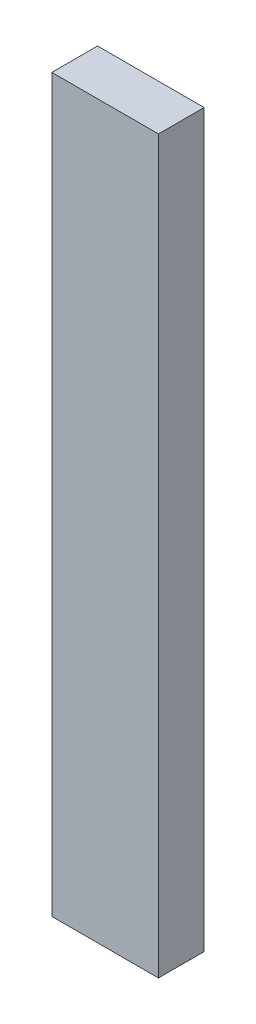
ISO-10303-21;
HEADER;
FILE_DESCRIPTION(('STEP AP214'),'2;1');
FILE_NAME('part.step','',(''),(''),'','','');
FILE_SCHEMA(('AUTOMOTIVE_DESIGN { 1 0 10303 214 1 1 1 1 }'));
ENDSEC;
DATA;
#1=APPLICATION_CONTEXT('core data for automotive mechanical design processes');
#2=APPLICATION_PROTOCOL_DEFINITION('international standard','automotive_design',2000,#1);
#3=PRODUCT_CONTEXT('',#1,'mechanical');
#4=PRODUCT('Part','Part','',(#3));
#5=PRODUCT_RELATED_PRODUCT_CATEGORY('part','',(#4));
#6=PRODUCT_DEFINITION_FORMATION('','',#4);
#7=PRODUCT_DEFINITION_CONTEXT('part definition',#1,'design');
#8=PRODUCT_DEFINITION('design','',#6,#7);
#9=PRODUCT_DEFINITION_SHAPE('','',#8);
#10=(LENGTH_UNIT() NAMED_UNIT(*) SI_UNIT(.MILLI.,.METRE.));
#11=(NAMED_UNIT(*) PLANE_ANGLE_UNIT() SI_UNIT($,.RADIAN.));
#12=(NAMED_UNIT(*) SI_UNIT($,.STERADIAN.) SOLID_ANGLE_UNIT());
#13=UNCERTAINTY_MEASURE_WITH_UNIT(LENGTH_MEASURE(1.E-05),#10,'distance_accuracy_value','');
#14=(GEOMETRIC_REPRESENTATION_CONTEXT(3) GLOBAL_UNCERTAINTY_ASSIGNED_CONTEXT((#13)) GLOBAL_UNIT_ASSIGNED_CONTEXT((#10,
#11,#12)) REPRESENTATION_CONTEXT('',''));
#15=CARTESIAN_POINT('',(0.,0.,0.));
#16=DIRECTION('',(0.,0.,1.));
#17=DIRECTION('',(1.,0.,0.));
#18=AXIS2_PLACEMENT_3D('',#15,#16,#17);
#19=CARTESIAN_POINT('',(-44.45,609.6,19.05));
#20=DIRECTION('',(-1.,0.,0.));
#21=DIRECTION('',(0.,0.,1.));
#22=AXIS2_PLACEMENT_3D('',#19,#20,#21);
#23=PLANE('',#22);
#24=DIRECTION('',(0.,0.,-1.));
#25=VECTOR('',#24,1.);
#26=CARTESIAN_POINT('',(-44.45,0.,19.05));
#27=LINE('',#26,#25);
#28=CARTESIAN_POINT('',(-44.45,0.,19.05));
#29=VERTEX_POINT('',#28);
#30=CARTESIAN_POINT('',(-44.45,0.,-19.05));
#31=VERTEX_POINT('',#30);
#32=EDGE_CURVE('E104',#29,#31,#27,.T.);
#33=ORIENTED_EDGE('',*,*,#32,.F.);
#34=DIRECTION('',(0.,-1.,0.));
#35=VECTOR('',#34,1.);
#36=CARTESIAN_POINT('',(-44.45,609.6,19.05));
#37=LINE('',#36,#35);
#38=CARTESIAN_POINT('',(-44.45,609.6,19.05));
#39=VERTEX_POINT('',#38);
#40=EDGE_CURVE('E11',#39,#29,#37,.T.);
#41=ORIENTED_EDGE('',*,*,#40,.F.);
#42=DIRECTION('',(0.,0.,-1.));
#43=VECTOR('',#42,1.);
#44=CARTESIAN_POINT('',(-44.45,609.6,19.05));
#45=LINE('',#44,#43);
#46=CARTESIAN_POINT('',(-44.45,609.6,-19.05));
#47=VERTEX_POINT('',#46);
#48=EDGE_CURVE('E99',#39,#47,#45,.T.);
#49=ORIENTED_EDGE('',*,*,#48,.T.);
#50=DIRECTION('',(0.,-1.,0.));
#51=VECTOR('',#50,1.);
#52=CARTESIAN_POINT('',(-44.45,609.6,-19.05));
#53=LINE('',#52,#51);
#54=EDGE_CURVE('E42',#47,#31,#53,.T.);
#55=ORIENTED_EDGE('',*,*,#54,.T.);
#56=EDGE_LOOP('',(#33,#41,#49,#55));
#57=FACE_BOUND('',#56,.T.);
#58=ADVANCED_FACE('F39',(#57),#23,.T.);
#59=CARTESIAN_POINT('',(-44.45,609.6,19.05));
#60=DIRECTION('',(0.,0.,-1.));
#61=DIRECTION('',(-1.,0.,0.));
#62=AXIS2_PLACEMENT_3D('',#59,#60,#61);
#63=PLANE('',#62);
#64=DIRECTION('',(1.,0.,0.));
#65=VECTOR('',#64,1.);
#66=CARTESIAN_POINT('',(-44.45,0.,19.05));
#67=LINE('',#66,#65);
#68=CARTESIAN_POINT('',(44.45,0.,19.05));
#69=VERTEX_POINT('',#68);
#70=EDGE_CURVE('E72',#29,#69,#67,.T.);
#71=ORIENTED_EDGE('',*,*,#70,.T.);
#72=DIRECTION('',(0.,-1.,0.));
#73=VECTOR('',#72,1.);
#74=CARTESIAN_POINT('',(44.45,609.6,19.05));
#75=LINE('',#74,#73);
#76=CARTESIAN_POINT('',(44.45,609.6,19.05));
#77=VERTEX_POINT('',#76);
#78=EDGE_CURVE('E48',#77,#69,#75,.T.);
#79=ORIENTED_EDGE('',*,*,#78,.F.);
#80=DIRECTION('',(1.,0.,0.));
#81=VECTOR('',#80,1.);
#82=CARTESIAN_POINT('',(-44.45,609.6,19.05));
#83=LINE('',#82,#81);
#84=EDGE_CURVE('E89',#39,#77,#83,.T.);
#85=ORIENTED_EDGE('',*,*,#84,.F.);
#86=ORIENTED_EDGE('',*,*,#40,.T.);
#87=EDGE_LOOP('',(#71,#79,#85,#86));
#88=FACE_BOUND('',#87,.T.);
#89=ADVANCED_FACE('F114',(#88),#63,.F.);
#90=CARTESIAN_POINT('',(44.45,609.6,19.05));
#91=DIRECTION('',(-1.,0.,0.));
#92=DIRECTION('',(0.,0.,1.));
#93=AXIS2_PLACEMENT_3D('',#90,#91,#92);
#94=PLANE('',#93);
#95=DIRECTION('',(0.,0.,-1.));
#96=VECTOR('',#95,1.);
#97=CARTESIAN_POINT('',(44.45,0.,19.05));
#98=LINE('',#97,#96);
#99=CARTESIAN_POINT('',(44.45,0.,-19.05));
#100=VERTEX_POINT('',#99);
#101=EDGE_CURVE('E96',#69,#100,#98,.T.);
#102=ORIENTED_EDGE('',*,*,#101,.T.);
#103=DIRECTION('',(0.,-1.,0.));
#104=VECTOR('',#103,1.);
#105=CARTESIAN_POINT('',(44.45,609.6,-19.05));
#106=LINE('',#105,#104);
#107=CARTESIAN_POINT('',(44.45,609.6,-19.05));
#108=VERTEX_POINT('',#107);
#109=EDGE_CURVE('E93',#108,#100,#106,.T.);
#110=ORIENTED_EDGE('',*,*,#109,.F.);
#111=DIRECTION('',(0.,0.,-1.));
#112=VECTOR('',#111,1.);
#113=CARTESIAN_POINT('',(44.45,609.6,19.05));
#114=LINE('',#113,#112);
#115=EDGE_CURVE('E84',#77,#108,#114,.T.);
#116=ORIENTED_EDGE('',*,*,#115,.F.);
#117=ORIENTED_EDGE('',*,*,#78,.T.);
#118=EDGE_LOOP('',(#102,#110,#116,#117));
#119=FACE_BOUND('',#118,.T.);
#120=ADVANCED_FACE('F94',(#119),#94,.F.);
#121=CARTESIAN_POINT('',(-44.45,609.6,-19.05));
#122=DIRECTION('',(0.,0.,-1.));
#123=DIRECTION('',(-1.,0.,0.));
#124=AXIS2_PLACEMENT_3D('',#121,#122,#123);
#125=PLANE('',#124);
#126=DIRECTION('',(1.,0.,0.));
#127=VECTOR('',#126,1.);
#128=CARTESIAN_POINT('',(-44.45,0.,-19.05));
#129=LINE('',#128,#127);
#130=EDGE_CURVE('E107',#31,#100,#129,.T.);
#131=ORIENTED_EDGE('',*,*,#130,.F.);
#132=ORIENTED_EDGE('',*,*,#54,.F.);
#133=DIRECTION('',(1.,0.,0.));
#134=VECTOR('',#133,1.);
#135=CARTESIAN_POINT('',(-44.45,609.6,-19.05));
#136=LINE('',#135,#134);
#137=EDGE_CURVE('E88',#47,#108,#136,.T.);
#138=ORIENTED_EDGE('',*,*,#137,.T.);
#139=ORIENTED_EDGE('',*,*,#109,.T.);
#140=EDGE_LOOP('',(#131,#132,#138,#139));
#141=FACE_BOUND('',#140,.T.);
#142=ADVANCED_FACE('F98',(#141),#125,.T.);
#143=CARTESIAN_POINT('',(0.,609.6,0.));
#144=DIRECTION('',(0.,-1.,0.));
#145=DIRECTION('',(0.,0.,-1.));
#146=AXIS2_PLACEMENT_3D('',#143,#144,#145);
#147=PLANE('',#146);
#148=ORIENTED_EDGE('',*,*,#48,.F.);
#149=ORIENTED_EDGE('',*,*,#84,.T.);
#150=ORIENTED_EDGE('',*,*,#115,.T.);
#151=ORIENTED_EDGE('',*,*,#137,.F.);
#152=EDGE_LOOP('',(#148,#149,#150,#151));
#153=FACE_BOUND('',#152,.T.);
#154=ADVANCED_FACE('F87',(#153),#147,.F.);
#155=CARTESIAN_POINT('',(0.,0.,0.));
#156=DIRECTION('',(0.,-1.,0.));
#157=DIRECTION('',(0.,0.,-1.));
#158=AXIS2_PLACEMENT_3D('',#155,#156,#157);
#159=PLANE('',#158);
#160=ORIENTED_EDGE('',*,*,#32,.T.);
#161=ORIENTED_EDGE('',*,*,#130,.T.);
#162=ORIENTED_EDGE('',*,*,#101,.F.);
#163=ORIENTED_EDGE('',*,*,#70,.F.);
#164=EDGE_LOOP('',(#160,#161,#162,#163));
#165=FACE_BOUND('',#164,.T.);
#166=ADVANCED_FACE('F112',(#165),#159,.T.);
#167=CLOSED_SHELL('',(#58,#89,#120,#142,#154,#166));
#168=MANIFOLD_SOLID_BREP('B2',#167);
#169=ADVANCED_BREP_SHAPE_REPRESENTATION('',(#18,#168),#14);
#170=SHAPE_DEFINITION_REPRESENTATION(#9,#169);
ENDSEC;
END-ISO-10303-21;
